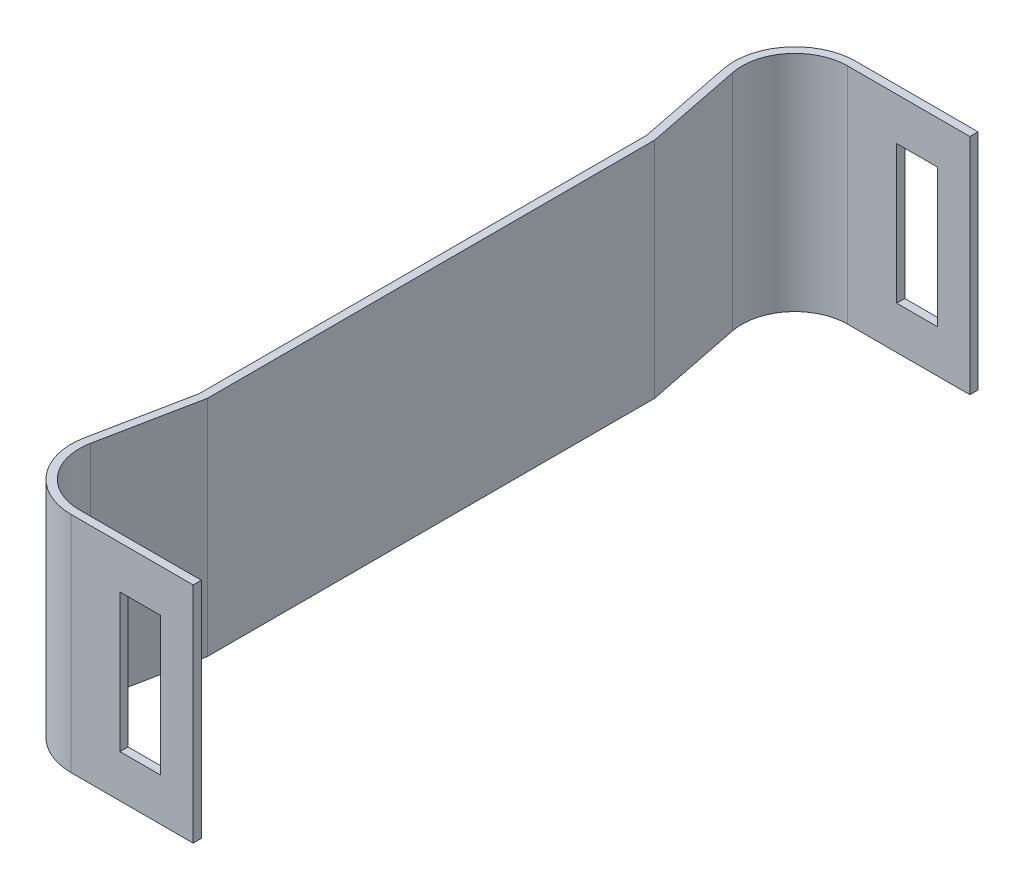
ISO-10303-21;
HEADER;
FILE_DESCRIPTION(('STEP AP214'),'2;1');
FILE_NAME('part.step','',(''),(''),'','','');
FILE_SCHEMA(('AUTOMOTIVE_DESIGN { 1 0 10303 214 1 1 1 1 }'));
ENDSEC;
DATA;
#1=APPLICATION_CONTEXT('core data for automotive mechanical design processes');
#2=APPLICATION_PROTOCOL_DEFINITION('international standard','automotive_design',2000,#1);
#3=PRODUCT_CONTEXT('',#1,'mechanical');
#4=PRODUCT('Part','Part','',(#3));
#5=PRODUCT_RELATED_PRODUCT_CATEGORY('part','',(#4));
#6=PRODUCT_DEFINITION_FORMATION('','',#4);
#7=PRODUCT_DEFINITION_CONTEXT('part definition',#1,'design');
#8=PRODUCT_DEFINITION('design','',#6,#7);
#9=PRODUCT_DEFINITION_SHAPE('','',#8);
#10=(LENGTH_UNIT() NAMED_UNIT(*) SI_UNIT(.MILLI.,.METRE.));
#11=(NAMED_UNIT(*) PLANE_ANGLE_UNIT() SI_UNIT($,.RADIAN.));
#12=(NAMED_UNIT(*) SI_UNIT($,.STERADIAN.) SOLID_ANGLE_UNIT());
#13=UNCERTAINTY_MEASURE_WITH_UNIT(LENGTH_MEASURE(1.E-05),#10,'distance_accuracy_value','');
#14=(GEOMETRIC_REPRESENTATION_CONTEXT(3) GLOBAL_UNCERTAINTY_ASSIGNED_CONTEXT((#13)) GLOBAL_UNIT_ASSIGNED_CONTEXT((#10,
#11,#12)) REPRESENTATION_CONTEXT('',''));
#15=CARTESIAN_POINT('',(0.,0.,0.));
#16=DIRECTION('',(0.,0.,1.));
#17=DIRECTION('',(1.,0.,0.));
#18=AXIS2_PLACEMENT_3D('',#15,#16,#17);
#19=CARTESIAN_POINT('',(-1.6,2.1,-18.900000004));
#20=DIRECTION('',(1.,0.,0.));
#21=DIRECTION('',(0.,0.,-1.));
#22=AXIS2_PLACEMENT_3D('',#19,#20,#21);
#23=PLANE('',#22);
#24=DIRECTION('',(0.,0.,-1.));
#25=VECTOR('',#24,1.);
#26=CARTESIAN_POINT('',(-1.6000000005,2.1,-18.900000004));
#27=LINE('',#26,#25);
#28=CARTESIAN_POINT('',(-1.600000000375,2.100000000125,-19.3));
#29=VERTEX_POINT('',#28);
#30=CARTESIAN_POINT('',(-1.60000000029275,2.1000000001875,-18.900000004));
#31=VERTEX_POINT('',#30);
#32=EDGE_CURVE('E369',#29,#31,#27,.F.);
#33=ORIENTED_EDGE('',*,*,#32,.T.);
#34=DIRECTION('',(0.,1.,0.));
#35=VECTOR('',#34,1.);
#36=CARTESIAN_POINT('',(-1.600000000671,0.,-18.900000004));
#37=LINE('',#36,#35);
#38=CARTESIAN_POINT('',(-1.6000000003355,8.8999999998125,-18.900000004));
#39=VERTEX_POINT('',#38);
#40=EDGE_CURVE('E303',#31,#39,#37,.T.);
#41=ORIENTED_EDGE('',*,*,#40,.T.);
#42=DIRECTION('',(0.,0.,1.));
#43=VECTOR('',#42,1.);
#44=CARTESIAN_POINT('',(-1.600000000671,8.9,-19.3));
#45=LINE('',#44,#43);
#46=CARTESIAN_POINT('',(-1.6000000004605,8.899999999875,-19.3));
#47=VERTEX_POINT('',#46);
#48=EDGE_CURVE('E373',#39,#47,#45,.F.);
#49=ORIENTED_EDGE('',*,*,#48,.T.);
#50=DIRECTION('',(0.,1.,0.));
#51=VECTOR('',#50,1.);
#52=CARTESIAN_POINT('',(-1.6000000005,0.,-19.3));
#53=LINE('',#52,#51);
#54=EDGE_CURVE('E310',#29,#47,#53,.T.);
#55=ORIENTED_EDGE('',*,*,#54,.F.);
#56=EDGE_LOOP('',(#33,#41,#49,#55));
#57=FACE_BOUND('',#56,.T.);
#58=ADVANCED_FACE('F17',(#57),#23,.F.);
#59=CARTESIAN_POINT('',(-3.6,8.9,-19.3));
#60=DIRECTION('',(0.,1.,0.));
#61=DIRECTION('',(0.,0.,1.));
#62=AXIS2_PLACEMENT_3D('',#59,#60,#61);
#63=PLANE('',#62);
#64=ORIENTED_EDGE('',*,*,#48,.F.);
#65=DIRECTION('',(-1.,0.,0.));
#66=VECTOR('',#65,1.);
#67=CARTESIAN_POINT('',(0.,8.89999999975,-18.900000004));
#68=LINE('',#67,#66);
#69=CARTESIAN_POINT('',(-3.60000000000225,8.899999999875,-18.900000004));
#70=VERTEX_POINT('',#69);
#71=EDGE_CURVE('E301',#39,#70,#68,.T.);
#72=ORIENTED_EDGE('',*,*,#71,.T.);
#73=DIRECTION('',(0.,0.,1.));
#74=VECTOR('',#73,1.);
#75=CARTESIAN_POINT('',(-3.6,8.89999999975,-19.3));
#76=LINE('',#75,#74);
#77=CARTESIAN_POINT('',(-3.6,8.899999999875,-19.3));
#78=VERTEX_POINT('',#77);
#79=EDGE_CURVE('E371',#70,#78,#76,.F.);
#80=ORIENTED_EDGE('',*,*,#79,.T.);
#81=DIRECTION('',(-1.,0.,0.));
#82=VECTOR('',#81,1.);
#83=CARTESIAN_POINT('',(0.,8.89999999975,-19.3));
#84=LINE('',#83,#82);
#85=EDGE_CURVE('E320',#47,#78,#84,.T.);
#86=ORIENTED_EDGE('',*,*,#85,.F.);
#87=EDGE_LOOP('',(#64,#72,#80,#86));
#88=FACE_BOUND('',#87,.T.);
#89=ADVANCED_FACE('F687',(#88),#63,.F.);
#90=CARTESIAN_POINT('',(-3.6,2.1,-19.3));
#91=DIRECTION('',(-1.,0.,0.));
#92=DIRECTION('',(0.,0.,1.));
#93=AXIS2_PLACEMENT_3D('',#90,#91,#92);
#94=PLANE('',#93);
#95=ORIENTED_EDGE('',*,*,#79,.F.);
#96=DIRECTION('',(0.,1.,0.));
#97=VECTOR('',#96,1.);
#98=CARTESIAN_POINT('',(-3.600000000009,0.,-18.900000004));
#99=LINE('',#98,#97);
#100=CARTESIAN_POINT('',(-3.6000000000045,2.1000000001875,-18.900000004));
#101=VERTEX_POINT('',#100);
#102=EDGE_CURVE('E299',#70,#101,#99,.F.);
#103=ORIENTED_EDGE('',*,*,#102,.T.);
#104=DIRECTION('',(0.,0.,-1.));
#105=VECTOR('',#104,1.);
#106=CARTESIAN_POINT('',(-3.600000000009,2.1,-18.900000004));
#107=LINE('',#106,#105);
#108=CARTESIAN_POINT('',(-3.60000000000225,2.1000000001875,-19.3));
#109=VERTEX_POINT('',#108);
#110=EDGE_CURVE('E362',#101,#109,#107,.T.);
#111=ORIENTED_EDGE('',*,*,#110,.T.);
#112=DIRECTION('',(0.,1.,0.));
#113=VECTOR('',#112,1.);
#114=CARTESIAN_POINT('',(-3.6,0.,-19.3));
#115=LINE('',#114,#113);
#116=EDGE_CURVE('E317',#78,#109,#115,.F.);
#117=ORIENTED_EDGE('',*,*,#116,.F.);
#118=EDGE_LOOP('',(#95,#103,#111,#117));
#119=FACE_BOUND('',#118,.T.);
#120=ADVANCED_FACE('F678',(#119),#94,.F.);
#121=CARTESIAN_POINT('',(-3.6,2.1,-18.900000004));
#122=DIRECTION('',(0.,-1.,0.));
#123=DIRECTION('',(0.,0.,-1.));
#124=AXIS2_PLACEMENT_3D('',#121,#122,#123);
#125=PLANE('',#124);
#126=ORIENTED_EDGE('',*,*,#110,.F.);
#127=DIRECTION('',(-1.,0.,0.));
#128=VECTOR('',#127,1.);
#129=CARTESIAN_POINT('',(0.,2.10000000025,-18.900000004));
#130=LINE('',#129,#128);
#131=EDGE_CURVE('E296',#101,#31,#130,.F.);
#132=ORIENTED_EDGE('',*,*,#131,.T.);
#133=ORIENTED_EDGE('',*,*,#32,.F.);
#134=DIRECTION('',(-1.,0.,0.));
#135=VECTOR('',#134,1.);
#136=CARTESIAN_POINT('',(0.,2.10000000025,-19.3));
#137=LINE('',#136,#135);
#138=EDGE_CURVE('E314',#109,#29,#137,.F.);
#139=ORIENTED_EDGE('',*,*,#138,.F.);
#140=EDGE_LOOP('',(#126,#132,#133,#139));
#141=FACE_BOUND('',#140,.T.);
#142=ADVANCED_FACE('F670',(#141),#125,.F.);
#143=CARTESIAN_POINT('',(0.,0.,-18.900000004));
#144=DIRECTION('',(1.,0.,0.));
#145=DIRECTION('',(0.,0.,-1.));
#146=AXIS2_PLACEMENT_3D('',#143,#144,#145);
#147=PLANE('',#146);
#148=DIRECTION('',(0.,1.,0.));
#149=VECTOR('',#148,1.);
#150=CARTESIAN_POINT('',(0.,0.,-18.900000004));
#151=LINE('',#150,#149);
#152=CARTESIAN_POINT('',(0.,11.,-18.9000000056867));
#153=VERTEX_POINT('',#152);
#154=CARTESIAN_POINT('',(0.,0.,-18.9000000056867));
#155=VERTEX_POINT('',#154);
#156=EDGE_CURVE('E295',#153,#155,#151,.F.);
#157=ORIENTED_EDGE('',*,*,#156,.T.);
#158=DIRECTION('',(0.,0.,-1.));
#159=VECTOR('',#158,1.);
#160=CARTESIAN_POINT('',(0.,0.,-18.900000004));
#161=LINE('',#160,#159);
#162=CARTESIAN_POINT('',(0.,0.,-19.3));
#163=VERTEX_POINT('',#162);
#164=EDGE_CURVE('E359',#155,#163,#161,.T.);
#165=ORIENTED_EDGE('',*,*,#164,.T.);
#166=DIRECTION('',(0.,1.,0.));
#167=VECTOR('',#166,1.);
#168=CARTESIAN_POINT('',(0.,0.,-19.3));
#169=LINE('',#168,#167);
#170=CARTESIAN_POINT('',(0.,11.,-19.3));
#171=VERTEX_POINT('',#170);
#172=EDGE_CURVE('E313',#171,#163,#169,.F.);
#173=ORIENTED_EDGE('',*,*,#172,.F.);
#174=DIRECTION('',(0.,0.,-1.));
#175=VECTOR('',#174,1.);
#176=CARTESIAN_POINT('',(0.,11.,-18.900000004));
#177=LINE('',#176,#175);
#178=EDGE_CURVE('E360',#171,#153,#177,.F.);
#179=ORIENTED_EDGE('',*,*,#178,.T.);
#180=EDGE_LOOP('',(#157,#165,#173,#179));
#181=FACE_BOUND('',#180,.T.);
#182=ADVANCED_FACE('F466',(#181),#147,.T.);
#183=CARTESIAN_POINT('',(-3.6,8.9,18.899999996));
#184=DIRECTION('',(0.,1.,0.));
#185=DIRECTION('',(0.,0.,1.));
#186=AXIS2_PLACEMENT_3D('',#183,#184,#185);
#187=PLANE('',#186);
#188=DIRECTION('',(1.,0.,0.));
#189=VECTOR('',#188,1.);
#190=CARTESIAN_POINT('',(-6.,8.89999999975,19.3));
#191=LINE('',#190,#189);
#192=CARTESIAN_POINT('',(-3.6000000000045,8.899999999875,19.3));
#193=VERTEX_POINT('',#192);
#194=CARTESIAN_POINT('',(-1.6000000011875,8.899999999875,19.3));
#195=VERTEX_POINT('',#194);
#196=EDGE_CURVE('E255',#193,#195,#191,.T.);
#197=ORIENTED_EDGE('',*,*,#196,.F.);
#198=DIRECTION('',(0.,0.,1.));
#199=VECTOR('',#198,1.);
#200=CARTESIAN_POINT('',(-3.6,8.89999999975,18.899999996));
#201=LINE('',#200,#199);
#202=CARTESIAN_POINT('',(-3.6000000000045,8.8999999998125,18.899999996));
#203=VERTEX_POINT('',#202);
#204=EDGE_CURVE('E346',#193,#203,#201,.F.);
#205=ORIENTED_EDGE('',*,*,#204,.T.);
#206=DIRECTION('',(1.,0.,0.));
#207=VECTOR('',#206,1.);
#208=CARTESIAN_POINT('',(-6.007911769,8.89999999975,18.899999996));
#209=LINE('',#208,#207);
#210=CARTESIAN_POINT('',(-1.60000000123025,8.899999999875,18.899999996));
#211=VERTEX_POINT('',#210);
#212=EDGE_CURVE('E269',#203,#211,#209,.T.);
#213=ORIENTED_EDGE('',*,*,#212,.T.);
#214=DIRECTION('',(0.,0.,-1.));
#215=VECTOR('',#214,1.);
#216=CARTESIAN_POINT('',(-1.600000001,8.89999999975,19.3));
#217=LINE('',#216,#215);
#218=EDGE_CURVE('E357',#211,#195,#217,.F.);
#219=ORIENTED_EDGE('',*,*,#218,.T.);
#220=EDGE_LOOP('',(#197,#205,#213,#219));
#221=FACE_BOUND('',#220,.T.);
#222=ADVANCED_FACE('F653',(#221),#187,.F.);
#223=CARTESIAN_POINT('',(-1.600000001,2.1,19.3));
#224=DIRECTION('',(1.,0.,0.));
#225=DIRECTION('',(0.,0.,-1.));
#226=AXIS2_PLACEMENT_3D('',#223,#224,#225);
#227=PLANE('',#226);
#228=DIRECTION('',(0.,1.,0.));
#229=VECTOR('',#228,1.);
#230=CARTESIAN_POINT('',(-1.60000000125,0.,19.3));
#231=LINE('',#230,#229);
#232=CARTESIAN_POINT('',(-1.60000000116775,2.1000000001875,19.3));
#233=VERTEX_POINT('',#232);
#234=EDGE_CURVE('E252',#195,#233,#231,.F.);
#235=ORIENTED_EDGE('',*,*,#234,.F.);
#236=ORIENTED_EDGE('',*,*,#218,.F.);
#237=DIRECTION('',(0.,1.,0.));
#238=VECTOR('',#237,1.);
#239=CARTESIAN_POINT('',(-1.600000001421,0.,18.899999996));
#240=LINE('',#239,#238);
#241=CARTESIAN_POINT('',(-1.6000000012105,2.1000000001875,18.899999996));
#242=VERTEX_POINT('',#241);
#243=EDGE_CURVE('E267',#211,#242,#240,.F.);
#244=ORIENTED_EDGE('',*,*,#243,.T.);
#245=DIRECTION('',(0.,0.,-1.));
#246=VECTOR('',#245,1.);
#247=CARTESIAN_POINT('',(-1.600000001421,2.1,19.3));
#248=LINE('',#247,#246);
#249=EDGE_CURVE('E355',#242,#233,#248,.F.);
#250=ORIENTED_EDGE('',*,*,#249,.T.);
#251=EDGE_LOOP('',(#235,#236,#244,#250));
#252=FACE_BOUND('',#251,.T.);
#253=ADVANCED_FACE('F644',(#252),#227,.F.);
#254=CARTESIAN_POINT('',(-3.6,2.1,19.3));
#255=DIRECTION('',(0.,-1.,0.));
#256=DIRECTION('',(0.,0.,-1.));
#257=AXIS2_PLACEMENT_3D('',#254,#255,#256);
#258=PLANE('',#257);
#259=DIRECTION('',(1.,0.,0.));
#260=VECTOR('',#259,1.);
#261=CARTESIAN_POINT('',(-6.,2.10000000025,19.3));
#262=LINE('',#261,#260);
#263=CARTESIAN_POINT('',(-3.6,2.100000000125,19.3));
#264=VERTEX_POINT('',#263);
#265=EDGE_CURVE('E249',#233,#264,#262,.F.);
#266=ORIENTED_EDGE('',*,*,#265,.F.);
#267=ORIENTED_EDGE('',*,*,#249,.F.);
#268=DIRECTION('',(1.,0.,0.));
#269=VECTOR('',#268,1.);
#270=CARTESIAN_POINT('',(-6.007911769,2.10000000025,18.899999996));
#271=LINE('',#270,#269);
#272=CARTESIAN_POINT('',(-3.60000000000225,2.1000000001875,18.899999996));
#273=VERTEX_POINT('',#272);
#274=EDGE_CURVE('E263',#242,#273,#271,.F.);
#275=ORIENTED_EDGE('',*,*,#274,.T.);
#276=DIRECTION('',(0.,0.,1.));
#277=VECTOR('',#276,1.);
#278=CARTESIAN_POINT('',(-3.6,2.10000000025,18.899999996));
#279=LINE('',#278,#277);
#280=EDGE_CURVE('E353',#273,#264,#279,.T.);
#281=ORIENTED_EDGE('',*,*,#280,.T.);
#282=EDGE_LOOP('',(#266,#267,#275,#281));
#283=FACE_BOUND('',#282,.T.);
#284=ADVANCED_FACE('F493',(#283),#258,.F.);
#285=CARTESIAN_POINT('',(-3.6,2.1,18.899999996));
#286=DIRECTION('',(-1.,0.,0.));
#287=DIRECTION('',(0.,0.,1.));
#288=AXIS2_PLACEMENT_3D('',#285,#286,#287);
#289=PLANE('',#288);
#290=DIRECTION('',(0.,1.,0.));
#291=VECTOR('',#290,1.);
#292=CARTESIAN_POINT('',(-3.6,0.,19.3));
#293=LINE('',#292,#291);
#294=EDGE_CURVE('E246',#264,#193,#293,.T.);
#295=ORIENTED_EDGE('',*,*,#294,.F.);
#296=ORIENTED_EDGE('',*,*,#280,.F.);
#297=DIRECTION('',(0.,1.,0.));
#298=VECTOR('',#297,1.);
#299=CARTESIAN_POINT('',(-3.600000000009,0.,18.899999996));
#300=LINE('',#299,#298);
#301=EDGE_CURVE('E271',#273,#203,#300,.T.);
#302=ORIENTED_EDGE('',*,*,#301,.T.);
#303=ORIENTED_EDGE('',*,*,#204,.F.);
#304=EDGE_LOOP('',(#295,#296,#302,#303));
#305=FACE_BOUND('',#304,.T.);
#306=ADVANCED_FACE('F485',(#305),#289,.F.);
#307=CARTESIAN_POINT('',(0.,0.,19.3));
#308=DIRECTION('',(1.,0.,0.));
#309=DIRECTION('',(0.,0.,-1.));
#310=AXIS2_PLACEMENT_3D('',#307,#308,#309);
#311=PLANE('',#310);
#312=DIRECTION('',(0.,1.,0.));
#313=VECTOR('',#312,1.);
#314=CARTESIAN_POINT('',(0.,0.,18.899999996));
#315=LINE('',#314,#313);
#316=CARTESIAN_POINT('',(0.,0.,18.8999999977333));
#317=VERTEX_POINT('',#316);
#318=CARTESIAN_POINT('',(0.,11.,18.8999999977333));
#319=VERTEX_POINT('',#318);
#320=EDGE_CURVE('E266',#317,#319,#315,.T.);
#321=ORIENTED_EDGE('',*,*,#320,.T.);
#322=DIRECTION('',(0.,0.,-1.));
#323=VECTOR('',#322,1.);
#324=CARTESIAN_POINT('',(0.,11.,19.3));
#325=LINE('',#324,#323);
#326=CARTESIAN_POINT('',(0.,11.,19.3));
#327=VERTEX_POINT('',#326);
#328=EDGE_CURVE('E323',#319,#327,#325,.F.);
#329=ORIENTED_EDGE('',*,*,#328,.T.);
#330=DIRECTION('',(0.,1.,0.));
#331=VECTOR('',#330,1.);
#332=CARTESIAN_POINT('',(0.,0.,19.3));
#333=LINE('',#332,#331);
#334=CARTESIAN_POINT('',(0.,0.,19.3));
#335=VERTEX_POINT('',#334);
#336=EDGE_CURVE('E245',#335,#327,#333,.T.);
#337=ORIENTED_EDGE('',*,*,#336,.F.);
#338=DIRECTION('',(0.,0.,-1.));
#339=VECTOR('',#338,1.);
#340=CARTESIAN_POINT('',(0.,0.,19.3));
#341=LINE('',#340,#339);
#342=EDGE_CURVE('E344',#335,#317,#341,.T.);
#343=ORIENTED_EDGE('',*,*,#342,.T.);
#344=EDGE_LOOP('',(#321,#329,#337,#343));
#345=FACE_BOUND('',#344,.T.);
#346=ADVANCED_FACE('F483',(#345),#311,.T.);
#347=CARTESIAN_POINT('',(-6.,11.,-16.3));
#348=DIRECTION('',(0.,-1.,0.));
#349=DIRECTION('',(0.,0.,-1.));
#350=AXIS2_PLACEMENT_3D('',#347,#348,#349);
#351=CYLINDRICAL_SURFACE('',#350,3.);
#352=DIRECTION('',(0.,1.,0.));
#353=VECTOR('',#352,1.);
#354=CARTESIAN_POINT('',(-8.94181264007211,0.,-15.7120047703608));
#355=LINE('',#354,#353);
#356=CARTESIAN_POINT('',(-8.94181264000455,11.,-15.7120047700228));
#357=VERTEX_POINT('',#356);
#358=CARTESIAN_POINT('',(-8.94181263918976,0.,-15.7120047718613));
#359=VERTEX_POINT('',#358);
#360=EDGE_CURVE('E329',#357,#359,#355,.F.);
#361=ORIENTED_EDGE('',*,*,#360,.F.);
#362=CARTESIAN_POINT('',(-6.,11.,-16.3));
#363=DIRECTION('',(0.,-1.,0.));
#364=DIRECTION('',(0.,0.,-1.));
#365=AXIS2_PLACEMENT_3D('',#362,#363,#364);
#366=CIRCLE('',#365,3.);
#367=CARTESIAN_POINT('',(-6.,11.,-19.3));
#368=VERTEX_POINT('',#367);
#369=EDGE_CURVE('E339',#357,#368,#366,.T.);
#370=ORIENTED_EDGE('',*,*,#369,.T.);
#371=DIRECTION('',(0.,1.,0.));
#372=VECTOR('',#371,1.);
#373=CARTESIAN_POINT('',(-6.,0.,-19.3));
#374=LINE('',#373,#372);
#375=CARTESIAN_POINT('',(-6.,0.,-19.3));
#376=VERTEX_POINT('',#375);
#377=EDGE_CURVE('E305',#376,#368,#374,.T.);
#378=ORIENTED_EDGE('',*,*,#377,.F.);
#379=CARTESIAN_POINT('',(-6.,0.,-16.3));
#380=DIRECTION('',(0.,-1.,0.));
#381=DIRECTION('',(0.,0.,-1.));
#382=AXIS2_PLACEMENT_3D('',#379,#380,#381);
#383=CIRCLE('',#382,3.);
#384=EDGE_CURVE('E384',#359,#376,#383,.T.);
#385=ORIENTED_EDGE('',*,*,#384,.F.);
#386=EDGE_LOOP('',(#361,#370,#378,#385));
#387=FACE_BOUND('',#386,.T.);
#388=ADVANCED_FACE('F457',(#387),#351,.T.);
#389=CARTESIAN_POINT('',(0.,0.,-19.3));
#390=DIRECTION('',(0.,0.,-1.));
#391=DIRECTION('',(-1.,0.,0.));
#392=AXIS2_PLACEMENT_3D('',#389,#390,#391);
#393=PLANE('',#392);
#394=DIRECTION('',(1.,0.,0.));
#395=VECTOR('',#394,1.);
#396=CARTESIAN_POINT('',(-9.054,0.,-19.3));
#397=LINE('',#396,#395);
#398=EDGE_CURVE('E387',#376,#163,#397,.T.);
#399=ORIENTED_EDGE('',*,*,#398,.F.);
#400=ORIENTED_EDGE('',*,*,#377,.T.);
#401=DIRECTION('',(1.,0.,0.));
#402=VECTOR('',#401,1.);
#403=CARTESIAN_POINT('',(-9.054,11.,-19.3));
#404=LINE('',#403,#402);
#405=EDGE_CURVE('E211',#368,#171,#404,.T.);
#406=ORIENTED_EDGE('',*,*,#405,.T.);
#407=ORIENTED_EDGE('',*,*,#172,.T.);
#408=EDGE_LOOP('',(#399,#400,#406,#407));
#409=FACE_BOUND('',#408,.T.);
#410=ORIENTED_EDGE('',*,*,#138,.T.);
#411=ORIENTED_EDGE('',*,*,#54,.T.);
#412=ORIENTED_EDGE('',*,*,#85,.T.);
#413=ORIENTED_EDGE('',*,*,#116,.T.);
#414=EDGE_LOOP('',(#410,#411,#412,#413));
#415=FACE_BOUND('',#414,.T.);
#416=ADVANCED_FACE('F461',(#409,#415),#393,.T.);
#417=CARTESIAN_POINT('',(0.,0.,-18.900000004));
#418=DIRECTION('',(0.,0.,-1.));
#419=DIRECTION('',(-1.,0.,0.));
#420=AXIS2_PLACEMENT_3D('',#417,#418,#419);
#421=PLANE('',#420);
#422=DIRECTION('',(1.,0.,0.));
#423=VECTOR('',#422,1.);
#424=CARTESIAN_POINT('',(-9.054,0.,-18.90000000653));
#425=LINE('',#424,#423);
#426=CARTESIAN_POINT('',(-6.007911769,0.,-18.900000005265));
#427=VERTEX_POINT('',#426);
#428=EDGE_CURVE('E383',#155,#427,#425,.F.);
#429=ORIENTED_EDGE('',*,*,#428,.F.);
#430=ORIENTED_EDGE('',*,*,#156,.F.);
#431=DIRECTION('',(1.,0.,0.));
#432=VECTOR('',#431,1.);
#433=CARTESIAN_POINT('',(-9.054,11.,-18.90000000653));
#434=LINE('',#433,#432);
#435=CARTESIAN_POINT('',(-6.007911769,11.,-18.900000005265));
#436=VERTEX_POINT('',#435);
#437=EDGE_CURVE('E175',#153,#436,#434,.F.);
#438=ORIENTED_EDGE('',*,*,#437,.T.);
#439=DIRECTION('',(0.,-1.,0.));
#440=VECTOR('',#439,1.);
#441=CARTESIAN_POINT('',(-6.007911769,11.,-18.900000004));
#442=LINE('',#441,#440);
#443=EDGE_CURVE('E185',#436,#427,#442,.T.);
#444=ORIENTED_EDGE('',*,*,#443,.T.);
#445=EDGE_LOOP('',(#429,#430,#438,#444));
#446=FACE_BOUND('',#445,.T.);
#447=ORIENTED_EDGE('',*,*,#102,.F.);
#448=ORIENTED_EDGE('',*,*,#71,.F.);
#449=ORIENTED_EDGE('',*,*,#40,.F.);
#450=ORIENTED_EDGE('',*,*,#131,.F.);
#451=EDGE_LOOP('',(#447,#448,#449,#450));
#452=FACE_BOUND('',#451,.T.);
#453=ADVANCED_FACE('F467',(#446,#452),#421,.F.);
#454=CARTESIAN_POINT('',(-6.007911769,11.,-16.300000004));
#455=DIRECTION('',(0.,-1.,0.));
#456=DIRECTION('',(0.,0.,-1.));
#457=AXIS2_PLACEMENT_3D('',#454,#455,#456);
#458=CYLINDRICAL_SURFACE('',#457,2.6);
#459=DIRECTION('',(0.,1.,0.));
#460=VECTOR('',#459,1.);
#461=CARTESIAN_POINT('',(-8.55748272305601,0.,-15.7904041372802));
#462=LINE('',#461,#460);
#463=CARTESIAN_POINT('',(-8.55748272308531,11.,-15.7904041374229));
#464=VERTEX_POINT('',#463);
#465=CARTESIAN_POINT('',(-8.55748272382033,0.,-15.7904041369593));
#466=VERTEX_POINT('',#465);
#467=EDGE_CURVE('E183',#464,#466,#462,.F.);
#468=ORIENTED_EDGE('',*,*,#467,.T.);
#469=CARTESIAN_POINT('',(-6.007911769,0.,-16.300000004));
#470=DIRECTION('',(0.,-1.,0.));
#471=DIRECTION('',(0.,0.,-1.));
#472=AXIS2_PLACEMENT_3D('',#469,#470,#471);
#473=CIRCLE('',#472,2.6);
#474=EDGE_CURVE('E381',#427,#466,#473,.F.);
#475=ORIENTED_EDGE('',*,*,#474,.F.);
#476=ORIENTED_EDGE('',*,*,#443,.F.);
#477=CARTESIAN_POINT('',(-6.007911769,11.,-16.300000004));
#478=DIRECTION('',(0.,-1.,0.));
#479=DIRECTION('',(0.,0.,-1.));
#480=AXIS2_PLACEMENT_3D('',#477,#478,#479);
#481=CIRCLE('',#480,2.6);
#482=EDGE_CURVE('E20',#436,#464,#481,.F.);
#483=ORIENTED_EDGE('',*,*,#482,.T.);
#484=EDGE_LOOP('',(#468,#475,#476,#483));
#485=FACE_BOUND('',#484,.T.);
#486=ADVANCED_FACE('F181',(#485),#458,.F.);
#487=CARTESIAN_POINT('',(-8.557482723,0.,-15.790404137));
#488=DIRECTION('',(-0.980604213327662,0.,0.195998410207932));
#489=DIRECTION('',(0.195998410207932,0.,0.980604213327662));
#490=AXIS2_PLACEMENT_3D('',#487,#488,#489);
#491=PLANE('',#490);
#492=DIRECTION('',(0.19599841020833,0.,0.980604213327583));
#493=VECTOR('',#492,1.);
#494=CARTESIAN_POINT('',(-8.557482723057,11.,-15.79040413728));
#495=LINE('',#494,#493);
#496=CARTESIAN_POINT('',(-7.59999999659467,11.,-10.99999999595));
#497=VERTEX_POINT('',#496);
#498=EDGE_CURVE('E188',#464,#497,#495,.T.);
#499=ORIENTED_EDGE('',*,*,#498,.T.);
#500=DIRECTION('',(0.,1.,0.));
#501=VECTOR('',#500,1.);
#502=CARTESIAN_POINT('',(-7.599999997,0.,-10.99999999595));
#503=LINE('',#502,#501);
#504=CARTESIAN_POINT('',(-7.59999999669467,0.,-10.9999999948967));
#505=VERTEX_POINT('',#504);
#506=EDGE_CURVE('E195',#497,#505,#503,.F.);
#507=ORIENTED_EDGE('',*,*,#506,.T.);
#508=DIRECTION('',(0.195998410442582,0.,0.980604213280762));
#509=VECTOR('',#508,1.);
#510=CARTESIAN_POINT('',(-8.557482724511,0.,-15.79040413627));
#511=LINE('',#510,#509);
#512=EDGE_CURVE('E193',#466,#505,#511,.T.);
#513=ORIENTED_EDGE('',*,*,#512,.F.);
#514=ORIENTED_EDGE('',*,*,#467,.F.);
#515=EDGE_LOOP('',(#499,#507,#513,#514));
#516=FACE_BOUND('',#515,.T.);
#517=ADVANCED_FACE('F190',(#516),#491,.F.);
#518=CARTESIAN_POINT('',(-7.599999997,0.,-10.999999999));
#519=DIRECTION('',(-1.,0.,0.));
#520=DIRECTION('',(0.,0.,1.));
#521=AXIS2_PLACEMENT_3D('',#518,#519,#520);
#522=PLANE('',#521);
#523=DIRECTION('',(0.,0.,-1.));
#524=VECTOR('',#523,1.);
#525=CARTESIAN_POINT('',(-7.599999996542,0.,19.3));
#526=LINE('',#525,#524);
#527=CARTESIAN_POINT('',(-7.59999999649199,0.,10.9999999909015));
#528=VERTEX_POINT('',#527);
#529=EDGE_CURVE('E285',#505,#528,#526,.F.);
#530=ORIENTED_EDGE('',*,*,#529,.F.);
#531=ORIENTED_EDGE('',*,*,#506,.F.);
#532=DIRECTION('',(0.,0.,-1.));
#533=VECTOR('',#532,1.);
#534=CARTESIAN_POINT('',(-7.599999996392,11.,19.3));
#535=LINE('',#534,#533);
#536=CARTESIAN_POINT('',(-7.59999999639199,11.,10.999999987958));
#537=VERTEX_POINT('',#536);
#538=EDGE_CURVE('E200',#497,#537,#535,.F.);
#539=ORIENTED_EDGE('',*,*,#538,.T.);
#540=DIRECTION('',(0.,1.,0.));
#541=VECTOR('',#540,1.);
#542=CARTESIAN_POINT('',(-7.59999999639198,0.,10.999999987958));
#543=LINE('',#542,#541);
#544=EDGE_CURVE('E281',#537,#528,#543,.F.);
#545=ORIENTED_EDGE('',*,*,#544,.T.);
#546=EDGE_LOOP('',(#530,#531,#539,#545));
#547=FACE_BOUND('',#546,.T.);
#548=ADVANCED_FACE('F472',(#547),#522,.F.);
#549=CARTESIAN_POINT('',(-7.599999997,0.,10.999999991));
#550=DIRECTION('',(-0.980604213335427,0.,-0.195998410169085));
#551=DIRECTION('',(-0.195998410169085,0.,0.980604213335427));
#552=AXIS2_PLACEMENT_3D('',#549,#550,#551);
#553=PLANE('',#552);
#554=DIRECTION('',(-0.195998410576312,0.,0.980604213254032));
#555=VECTOR('',#554,1.);
#556=CARTESIAN_POINT('',(-7.599999996157,0.,10.999999990447));
#557=LINE('',#556,#555);
#558=CARTESIAN_POINT('',(-8.55748272388061,0.,15.7904041291619));
#559=VERTEX_POINT('',#558);
#560=EDGE_CURVE('E288',#528,#559,#557,.T.);
#561=ORIENTED_EDGE('',*,*,#560,.F.);
#562=ORIENTED_EDGE('',*,*,#544,.F.);
#563=DIRECTION('',(-0.195998410243857,0.,0.980604213320482));
#564=VECTOR('',#563,1.);
#565=CARTESIAN_POINT('',(-7.599999996392,11.,10.999999987958));
#566=LINE('',#565,#564);
#567=CARTESIAN_POINT('',(-8.55748272350713,11.,15.790404129686));
#568=VERTEX_POINT('',#567);
#569=EDGE_CURVE('E202',#537,#568,#566,.T.);
#570=ORIENTED_EDGE('',*,*,#569,.T.);
#571=DIRECTION('',(0.,-1.,0.));
#572=VECTOR('',#571,1.);
#573=CARTESIAN_POINT('',(-8.55748272374657,11.,15.7904041299329));
#574=LINE('',#573,#572);
#575=EDGE_CURVE('E274',#568,#559,#574,.T.);
#576=ORIENTED_EDGE('',*,*,#575,.T.);
#577=EDGE_LOOP('',(#561,#562,#570,#576));
#578=FACE_BOUND('',#577,.T.);
#579=ADVANCED_FACE('F473',(#578),#553,.F.);
#580=CARTESIAN_POINT('',(-6.007911769,11.,16.299999996));
#581=DIRECTION('',(0.,-1.,0.));
#582=DIRECTION('',(0.,0.,-1.));
#583=AXIS2_PLACEMENT_3D('',#580,#581,#582);
#584=CYLINDRICAL_SURFACE('',#583,2.6);
#585=DIRECTION('',(0.,1.,0.));
#586=VECTOR('',#585,1.);
#587=CARTESIAN_POINT('',(-6.007911769,0.,18.899999996));
#588=LINE('',#587,#586);
#589=CARTESIAN_POINT('',(-6.007911769,11.,18.899999996));
#590=VERTEX_POINT('',#589);
#591=CARTESIAN_POINT('',(-6.007911769,0.,18.899999996));
#592=VERTEX_POINT('',#591);
#593=EDGE_CURVE('E258',#590,#592,#588,.F.);
#594=ORIENTED_EDGE('',*,*,#593,.T.);
#595=CARTESIAN_POINT('',(-6.007911769,0.,16.299999996));
#596=DIRECTION('',(0.,-1.,0.));
#597=DIRECTION('',(0.,0.,-1.));
#598=AXIS2_PLACEMENT_3D('',#595,#596,#597);
#599=CIRCLE('',#598,2.6);
#600=EDGE_CURVE('E377',#559,#592,#599,.F.);
#601=ORIENTED_EDGE('',*,*,#600,.F.);
#602=ORIENTED_EDGE('',*,*,#575,.F.);
#603=CARTESIAN_POINT('',(-6.007911769,11.,16.299999996));
#604=DIRECTION('',(0.,-1.,0.));
#605=DIRECTION('',(0.,0.,-1.));
#606=AXIS2_PLACEMENT_3D('',#603,#604,#605);
#607=CIRCLE('',#606,2.6);
#608=EDGE_CURVE('E392',#568,#590,#607,.F.);
#609=ORIENTED_EDGE('',*,*,#608,.T.);
#610=EDGE_LOOP('',(#594,#601,#602,#609));
#611=FACE_BOUND('',#610,.T.);
#612=ADVANCED_FACE('F475',(#611),#584,.F.);
#613=CARTESIAN_POINT('',(-6.007911769,0.,18.899999996));
#614=DIRECTION('',(0.,0.,1.));
#615=DIRECTION('',(1.,0.,0.));
#616=AXIS2_PLACEMENT_3D('',#613,#614,#615);
#617=PLANE('',#616);
#618=DIRECTION('',(1.,0.,0.));
#619=VECTOR('',#618,1.);
#620=CARTESIAN_POINT('',(-9.054,11.,18.899999996));
#621=LINE('',#620,#619);
#622=EDGE_CURVE('E393',#590,#319,#621,.T.);
#623=ORIENTED_EDGE('',*,*,#622,.T.);
#624=ORIENTED_EDGE('',*,*,#320,.F.);
#625=DIRECTION('',(1.,0.,0.));
#626=VECTOR('',#625,1.);
#627=CARTESIAN_POINT('',(-9.054,0.,18.899999996));
#628=LINE('',#627,#626);
#629=EDGE_CURVE('E380',#592,#317,#628,.T.);
#630=ORIENTED_EDGE('',*,*,#629,.F.);
#631=ORIENTED_EDGE('',*,*,#593,.F.);
#632=EDGE_LOOP('',(#623,#624,#630,#631));
#633=FACE_BOUND('',#632,.T.);
#634=ORIENTED_EDGE('',*,*,#243,.F.);
#635=ORIENTED_EDGE('',*,*,#212,.F.);
#636=ORIENTED_EDGE('',*,*,#301,.F.);
#637=ORIENTED_EDGE('',*,*,#274,.F.);
#638=EDGE_LOOP('',(#634,#635,#636,#637));
#639=FACE_BOUND('',#638,.T.);
#640=ADVANCED_FACE('F479',(#633,#639),#617,.F.);
#641=CARTESIAN_POINT('',(-6.,0.,19.3));
#642=DIRECTION('',(0.,0.,1.));
#643=DIRECTION('',(1.,0.,0.));
#644=AXIS2_PLACEMENT_3D('',#641,#642,#643);
#645=PLANE('',#644);
#646=DIRECTION('',(1.,0.,0.));
#647=VECTOR('',#646,1.);
#648=CARTESIAN_POINT('',(-9.054,11.,19.3));
#649=LINE('',#648,#647);
#650=CARTESIAN_POINT('',(-6.,11.,19.3));
#651=VERTEX_POINT('',#650);
#652=EDGE_CURVE('E391',#327,#651,#649,.F.);
#653=ORIENTED_EDGE('',*,*,#652,.T.);
#654=DIRECTION('',(0.,-1.,0.));
#655=VECTOR('',#654,1.);
#656=CARTESIAN_POINT('',(-6.,11.,19.3));
#657=LINE('',#656,#655);
#658=CARTESIAN_POINT('',(-6.,0.,19.3));
#659=VERTEX_POINT('',#658);
#660=EDGE_CURVE('E216',#659,#651,#657,.F.);
#661=ORIENTED_EDGE('',*,*,#660,.F.);
#662=DIRECTION('',(1.,0.,0.));
#663=VECTOR('',#662,1.);
#664=CARTESIAN_POINT('',(-9.054,0.,19.3));
#665=LINE('',#664,#663);
#666=EDGE_CURVE('E376',#335,#659,#665,.F.);
#667=ORIENTED_EDGE('',*,*,#666,.F.);
#668=ORIENTED_EDGE('',*,*,#336,.T.);
#669=EDGE_LOOP('',(#653,#661,#667,#668));
#670=FACE_BOUND('',#669,.T.);
#671=ORIENTED_EDGE('',*,*,#265,.T.);
#672=ORIENTED_EDGE('',*,*,#294,.T.);
#673=ORIENTED_EDGE('',*,*,#196,.T.);
#674=ORIENTED_EDGE('',*,*,#234,.T.);
#675=EDGE_LOOP('',(#671,#672,#673,#674));
#676=FACE_BOUND('',#675,.T.);
#677=ADVANCED_FACE('F440',(#670,#676),#645,.T.);
#678=CARTESIAN_POINT('',(-6.,11.,16.3));
#679=DIRECTION('',(0.,-1.,0.));
#680=DIRECTION('',(0.,0.,-1.));
#681=AXIS2_PLACEMENT_3D('',#678,#679,#680);
#682=CYLINDRICAL_SURFACE('',#681,3.);
#683=ORIENTED_EDGE('',*,*,#660,.T.);
#684=CARTESIAN_POINT('',(-6.,11.,16.3));
#685=DIRECTION('',(0.,-1.,0.));
#686=DIRECTION('',(0.,0.,-1.));
#687=AXIS2_PLACEMENT_3D('',#684,#685,#686);
#688=CIRCLE('',#687,3.);
#689=CARTESIAN_POINT('',(-8.94181264027225,11.,15.7120047713554));
#690=VERTEX_POINT('',#689);
#691=EDGE_CURVE('E390',#651,#690,#688,.T.);
#692=ORIENTED_EDGE('',*,*,#691,.T.);
#693=DIRECTION('',(0.,1.,0.));
#694=VECTOR('',#693,1.);
#695=CARTESIAN_POINT('',(-8.94181264060621,0.,15.7120047730262));
#696=LINE('',#695,#694);
#697=CARTESIAN_POINT('',(-8.94181264027225,0.,15.7120047713554));
#698=VERTEX_POINT('',#697);
#699=EDGE_CURVE('E219',#698,#690,#696,.T.);
#700=ORIENTED_EDGE('',*,*,#699,.F.);
#701=CARTESIAN_POINT('',(-6.,0.,16.3));
#702=DIRECTION('',(0.,-1.,0.));
#703=DIRECTION('',(0.,0.,-1.));
#704=AXIS2_PLACEMENT_3D('',#701,#702,#703);
#705=CIRCLE('',#704,3.);
#706=EDGE_CURVE('E236',#659,#698,#705,.T.);
#707=ORIENTED_EDGE('',*,*,#706,.F.);
#708=EDGE_LOOP('',(#683,#692,#700,#707));
#709=FACE_BOUND('',#708,.T.);
#710=ADVANCED_FACE('F445',(#709),#682,.T.);
#711=CARTESIAN_POINT('',(-9.054,11.,19.3));
#712=DIRECTION('',(0.,-1.,0.));
#713=DIRECTION('',(0.,0.,-1.));
#714=AXIS2_PLACEMENT_3D('',#711,#712,#713);
#715=PLANE('',#714);
#716=DIRECTION('',(0.195998410111969,0.,0.980604213346843));
#717=VECTOR('',#716,1.);
#718=CARTESIAN_POINT('',(-8.94181264,11.,-15.71200477));
#719=LINE('',#718,#717);
#720=CARTESIAN_POINT('',(-8.00000000107658,11.,-11.0000000092076));
#721=VERTEX_POINT('',#720);
#722=EDGE_CURVE('E332',#721,#357,#719,.F.);
#723=ORIENTED_EDGE('',*,*,#722,.F.);
#724=DIRECTION('',(0.,0.,1.));
#725=VECTOR('',#724,1.);
#726=CARTESIAN_POINT('',(-8.000000001,11.,-11.000000007));
#727=LINE('',#726,#725);
#728=CARTESIAN_POINT('',(-8.00000000111404,11.,11.0000000032705));
#729=VERTEX_POINT('',#728);
#730=EDGE_CURVE('E222',#729,#721,#727,.F.);
#731=ORIENTED_EDGE('',*,*,#730,.F.);
#732=DIRECTION('',(-0.195998410111969,0.,0.980604213346843));
#733=VECTOR('',#732,1.);
#734=CARTESIAN_POINT('',(-8.000000001,11.,11.000000007));
#735=LINE('',#734,#733);
#736=EDGE_CURVE('E224',#690,#729,#735,.F.);
#737=ORIENTED_EDGE('',*,*,#736,.F.);
#738=ORIENTED_EDGE('',*,*,#691,.F.);
#739=ORIENTED_EDGE('',*,*,#652,.F.);
#740=ORIENTED_EDGE('',*,*,#328,.F.);
#741=ORIENTED_EDGE('',*,*,#622,.F.);
#742=ORIENTED_EDGE('',*,*,#608,.F.);
#743=ORIENTED_EDGE('',*,*,#569,.F.);
#744=ORIENTED_EDGE('',*,*,#538,.F.);
#745=ORIENTED_EDGE('',*,*,#498,.F.);
#746=ORIENTED_EDGE('',*,*,#482,.F.);
#747=ORIENTED_EDGE('',*,*,#437,.F.);
#748=ORIENTED_EDGE('',*,*,#178,.F.);
#749=ORIENTED_EDGE('',*,*,#405,.F.);
#750=ORIENTED_EDGE('',*,*,#369,.F.);
#751=EDGE_LOOP('',(#723,#731,#737,#738,#739,#740,#741,#742,#743,#744,#745,#746,#747,#748,#749,#750));
#752=FACE_BOUND('',#751,.T.);
#753=ADVANCED_FACE('F198',(#752),#715,.F.);
#754=CARTESIAN_POINT('',(-8.94181264,0.,-15.71200477));
#755=DIRECTION('',(-0.980604213346843,0.,0.195998410111969));
#756=DIRECTION('',(0.195998410111969,0.,0.980604213346843));
#757=AXIS2_PLACEMENT_3D('',#754,#755,#756);
#758=PLANE('',#757);
#759=ORIENTED_EDGE('',*,*,#722,.T.);
#760=ORIENTED_EDGE('',*,*,#360,.T.);
#761=DIRECTION('',(-0.195998409037804,0.,-0.980604213561542));
#762=VECTOR('',#761,1.);
#763=CARTESIAN_POINT('',(-8.000000002283,0.,-10.9999999984));
#764=LINE('',#763,#762);
#765=CARTESIAN_POINT('',(-8.000000001641,0.,-11.0000000001499));
#766=VERTEX_POINT('',#765);
#767=EDGE_CURVE('E331',#766,#359,#764,.T.);
#768=ORIENTED_EDGE('',*,*,#767,.F.);
#769=DIRECTION('',(0.,1.,0.));
#770=VECTOR('',#769,1.);
#771=CARTESIAN_POINT('',(-8.000000001,0.,-11.00000001127));
#772=LINE('',#771,#770);
#773=EDGE_CURVE('E231',#721,#766,#772,.F.);
#774=ORIENTED_EDGE('',*,*,#773,.F.);
#775=EDGE_LOOP('',(#759,#760,#768,#774));
#776=FACE_BOUND('',#775,.T.);
#777=ADVANCED_FACE('F454',(#776),#758,.T.);
#778=CARTESIAN_POINT('',(-9.054,0.,19.3));
#779=DIRECTION('',(0.,-1.,0.));
#780=DIRECTION('',(0.,0.,-1.));
#781=AXIS2_PLACEMENT_3D('',#778,#779,#780);
#782=PLANE('',#781);
#783=ORIENTED_EDGE('',*,*,#666,.T.);
#784=ORIENTED_EDGE('',*,*,#706,.T.);
#785=DIRECTION('',(-0.195998410111969,0.,0.980604213346843));
#786=VECTOR('',#785,1.);
#787=CARTESIAN_POINT('',(-8.000000001,0.,11.000000007));
#788=LINE('',#787,#786);
#789=CARTESIAN_POINT('',(-7.99999999999872,0.,11.0000000019905));
#790=VERTEX_POINT('',#789);
#791=EDGE_CURVE('E35',#790,#698,#788,.T.);
#792=ORIENTED_EDGE('',*,*,#791,.F.);
#793=DIRECTION('',(0.,0.,1.));
#794=VECTOR('',#793,1.);
#795=CARTESIAN_POINT('',(-8.000000001,0.,-11.000000007));
#796=LINE('',#795,#794);
#797=EDGE_CURVE('E26',#766,#790,#796,.T.);
#798=ORIENTED_EDGE('',*,*,#797,.F.);
#799=ORIENTED_EDGE('',*,*,#767,.T.);
#800=ORIENTED_EDGE('',*,*,#384,.T.);
#801=ORIENTED_EDGE('',*,*,#398,.T.);
#802=ORIENTED_EDGE('',*,*,#164,.F.);
#803=ORIENTED_EDGE('',*,*,#428,.T.);
#804=ORIENTED_EDGE('',*,*,#474,.T.);
#805=ORIENTED_EDGE('',*,*,#512,.T.);
#806=ORIENTED_EDGE('',*,*,#529,.T.);
#807=ORIENTED_EDGE('',*,*,#560,.T.);
#808=ORIENTED_EDGE('',*,*,#600,.T.);
#809=ORIENTED_EDGE('',*,*,#629,.T.);
#810=ORIENTED_EDGE('',*,*,#342,.F.);
#811=EDGE_LOOP('',(#783,#784,#792,#798,#799,#800,#801,#802,#803,#804,#805,#806,#807,#808,#809,#810));
#812=FACE_BOUND('',#811,.T.);
#813=ADVANCED_FACE('F435',(#812),#782,.T.);
#814=CARTESIAN_POINT('',(-8.000000001,0.,11.000000007));
#815=DIRECTION('',(-0.980604213346843,0.,-0.195998410111969));
#816=DIRECTION('',(-0.195998410111969,0.,0.980604213346843));
#817=AXIS2_PLACEMENT_3D('',#814,#815,#816);
#818=PLANE('',#817);
#819=ORIENTED_EDGE('',*,*,#791,.T.);
#820=ORIENTED_EDGE('',*,*,#699,.T.);
#821=ORIENTED_EDGE('',*,*,#736,.T.);
#822=DIRECTION('',(0.,1.,0.));
#823=VECTOR('',#822,1.);
#824=CARTESIAN_POINT('',(-8.000000001,0.,10.9999999984));
#825=LINE('',#824,#823);
#826=EDGE_CURVE('E11',#790,#729,#825,.T.);
#827=ORIENTED_EDGE('',*,*,#826,.F.);
#828=EDGE_LOOP('',(#819,#820,#821,#827));
#829=FACE_BOUND('',#828,.T.);
#830=ADVANCED_FACE('F448',(#829),#818,.T.);
#831=CARTESIAN_POINT('',(-8.000000001,0.,-11.000000007));
#832=DIRECTION('',(-1.,0.,0.));
#833=DIRECTION('',(0.,0.,1.));
#834=AXIS2_PLACEMENT_3D('',#831,#832,#833);
#835=PLANE('',#834);
#836=ORIENTED_EDGE('',*,*,#797,.T.);
#837=ORIENTED_EDGE('',*,*,#826,.T.);
#838=ORIENTED_EDGE('',*,*,#730,.T.);
#839=ORIENTED_EDGE('',*,*,#773,.T.);
#840=EDGE_LOOP('',(#836,#837,#838,#839));
#841=FACE_BOUND('',#840,.T.);
#842=ADVANCED_FACE('F450',(#841),#835,.T.);
#843=CLOSED_SHELL('',(#58,#89,#120,#142,#182,#222,#253,#284,#306,#346,#388,#416,#453,#486,#517,
#548,#579,#612,#640,#677,#710,#753,#777,#813,#830,#842));
#844=MANIFOLD_SOLID_BREP('B1',#843);
#845=ADVANCED_BREP_SHAPE_REPRESENTATION('',(#18,#844),#14);
#846=SHAPE_DEFINITION_REPRESENTATION(#9,#845);
ENDSEC;
END-ISO-10303-21;
